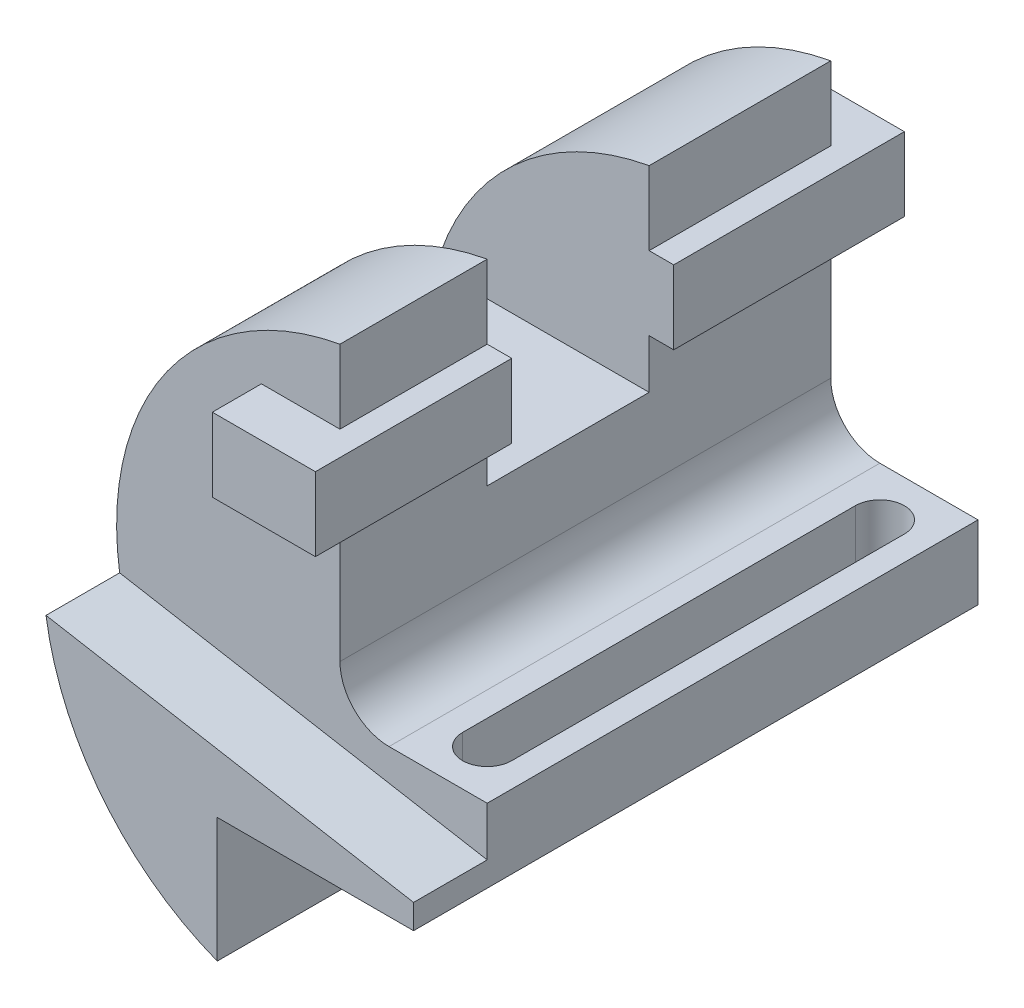
ISO-10303-21;
HEADER;
FILE_DESCRIPTION(('STEP AP214'),'2;1');
FILE_NAME('part.step','',(''),(''),'','','');
FILE_SCHEMA(('AUTOMOTIVE_DESIGN { 1 0 10303 214 1 1 1 1 }'));
ENDSEC;
DATA;
#1=APPLICATION_CONTEXT('core data for automotive mechanical design processes');
#2=APPLICATION_PROTOCOL_DEFINITION('international standard','automotive_design',2000,#1);
#3=PRODUCT_CONTEXT('',#1,'mechanical');
#4=PRODUCT('Part','Part','',(#3));
#5=PRODUCT_RELATED_PRODUCT_CATEGORY('part','',(#4));
#6=PRODUCT_DEFINITION_FORMATION('','',#4);
#7=PRODUCT_DEFINITION_CONTEXT('part definition',#1,'design');
#8=PRODUCT_DEFINITION('design','',#6,#7);
#9=PRODUCT_DEFINITION_SHAPE('','',#8);
#10=(LENGTH_UNIT() NAMED_UNIT(*) SI_UNIT(.MILLI.,.METRE.));
#11=(NAMED_UNIT(*) PLANE_ANGLE_UNIT() SI_UNIT($,.RADIAN.));
#12=(NAMED_UNIT(*) SI_UNIT($,.STERADIAN.) SOLID_ANGLE_UNIT());
#13=UNCERTAINTY_MEASURE_WITH_UNIT(LENGTH_MEASURE(1.E-05),#10,'distance_accuracy_value','');
#14=(GEOMETRIC_REPRESENTATION_CONTEXT(3) GLOBAL_UNCERTAINTY_ASSIGNED_CONTEXT((#13)) GLOBAL_UNIT_ASSIGNED_CONTEXT((#10,
#11,#12)) REPRESENTATION_CONTEXT('',''));
#15=CARTESIAN_POINT('',(0.,0.,0.));
#16=DIRECTION('',(0.,0.,1.));
#17=DIRECTION('',(1.,0.,0.));
#18=AXIS2_PLACEMENT_3D('',#15,#16,#17);
#19=CARTESIAN_POINT('',(0.,0.,115.));
#20=DIRECTION('',(-1.,0.,0.));
#21=DIRECTION('',(0.,-1.,0.));
#22=AXIS2_PLACEMENT_3D('',#19,#20,#21);
#23=PLANE('',#22);
#24=DIRECTION('',(0.,0.,1.));
#25=VECTOR('',#24,1.);
#26=CARTESIAN_POINT('',(0.,51.,115.));
#27=LINE('',#26,#25);
#28=CARTESIAN_POINT('',(0.,51.,70.));
#29=VERTEX_POINT('',#28);
#30=CARTESIAN_POINT('',(0.,51.,100.));
#31=VERTEX_POINT('',#30);
#32=EDGE_CURVE('E338',#29,#31,#27,.T.);
#33=ORIENTED_EDGE('',*,*,#32,.F.);
#34=DIRECTION('',(0.,1.,0.));
#35=VECTOR('',#34,1.);
#36=CARTESIAN_POINT('',(0.,0.,70.));
#37=LINE('',#36,#35);
#38=CARTESIAN_POINT('',(0.,66.,70.));
#39=VERTEX_POINT('',#38);
#40=EDGE_CURVE('E289',#29,#39,#37,.T.);
#41=ORIENTED_EDGE('',*,*,#40,.T.);
#42=DIRECTION('',(0.,0.,-1.));
#43=VECTOR('',#42,1.);
#44=CARTESIAN_POINT('',(0.,66.,115.));
#45=LINE('',#44,#43);
#46=CARTESIAN_POINT('',(0.,66.,100.));
#47=VERTEX_POINT('',#46);
#48=EDGE_CURVE('E406',#47,#39,#45,.T.);
#49=ORIENTED_EDGE('',*,*,#48,.F.);
#50=DIRECTION('',(0.,1.,0.));
#51=VECTOR('',#50,1.);
#52=CARTESIAN_POINT('',(0.,0.,100.));
#53=LINE('',#52,#51);
#54=EDGE_CURVE('E357',#31,#47,#53,.T.);
#55=ORIENTED_EDGE('',*,*,#54,.F.);
#56=EDGE_LOOP('',(#33,#41,#49,#55));
#57=FACE_BOUND('',#56,.T.);
#58=ADVANCED_FACE('F43',(#57),#23,.F.);
#59=CARTESIAN_POINT('',(-16.,36.,-10.));
#60=DIRECTION('',(0.,1.,0.));
#61=DIRECTION('',(0.,0.,1.));
#62=AXIS2_PLACEMENT_3D('',#59,#60,#61);
#63=PLANE('',#62);
#64=DIRECTION('',(0.,0.,-1.));
#65=VECTOR('',#64,1.);
#66=CARTESIAN_POINT('',(0.,36.,115.));
#67=LINE('',#66,#65);
#68=CARTESIAN_POINT('',(0.,36.,100.));
#69=VERTEX_POINT('',#68);
#70=CARTESIAN_POINT('',(0.,36.,70.));
#71=VERTEX_POINT('',#70);
#72=EDGE_CURVE('E347',#69,#71,#67,.T.);
#73=ORIENTED_EDGE('',*,*,#72,.T.);
#74=DIRECTION('',(1.,0.,0.));
#75=VECTOR('',#74,1.);
#76=CARTESIAN_POINT('',(-16.,36.,70.));
#77=LINE('',#76,#75);
#78=CARTESIAN_POINT('',(5.,36.,70.));
#79=VERTEX_POINT('',#78);
#80=EDGE_CURVE('E286',#71,#79,#77,.T.);
#81=ORIENTED_EDGE('',*,*,#80,.T.);
#82=DIRECTION('',(0.,0.,1.));
#83=VECTOR('',#82,1.);
#84=CARTESIAN_POINT('',(5.,36.,-10.));
#85=LINE('',#84,#83);
#86=CARTESIAN_POINT('',(5.,36.,110.));
#87=VERTEX_POINT('',#86);
#88=EDGE_CURVE('E334',#79,#87,#85,.T.);
#89=ORIENTED_EDGE('',*,*,#88,.T.);
#90=DIRECTION('',(-1.,0.,0.));
#91=VECTOR('',#90,1.);
#92=CARTESIAN_POINT('',(-16.,36.,110.));
#93=LINE('',#92,#91);
#94=CARTESIAN_POINT('',(-16.,36.,110.));
#95=VERTEX_POINT('',#94);
#96=EDGE_CURVE('E301',#87,#95,#93,.T.);
#97=ORIENTED_EDGE('',*,*,#96,.T.);
#98=DIRECTION('',(0.,0.,1.));
#99=VECTOR('',#98,1.);
#100=CARTESIAN_POINT('',(-16.,36.,-10.));
#101=LINE('',#100,#99);
#102=CARTESIAN_POINT('',(-16.,36.,100.));
#103=VERTEX_POINT('',#102);
#104=EDGE_CURVE('E330',#103,#95,#101,.T.);
#105=ORIENTED_EDGE('',*,*,#104,.F.);
#106=DIRECTION('',(-1.,0.,0.));
#107=VECTOR('',#106,1.);
#108=CARTESIAN_POINT('',(10.,36.,100.));
#109=LINE('',#108,#107);
#110=EDGE_CURVE('E415',#69,#103,#109,.T.);
#111=ORIENTED_EDGE('',*,*,#110,.F.);
#112=EDGE_LOOP('',(#73,#81,#89,#97,#105,#111));
#113=FACE_BOUND('',#112,.T.);
#114=ADVANCED_FACE('F513',(#113),#63,.F.);
#115=CARTESIAN_POINT('',(5.,51.,-10.));
#116=DIRECTION('',(0.,-1.,0.));
#117=DIRECTION('',(0.,0.,-1.));
#118=AXIS2_PLACEMENT_3D('',#115,#116,#117);
#119=PLANE('',#118);
#120=DIRECTION('',(0.,0.,1.));
#121=VECTOR('',#120,1.);
#122=CARTESIAN_POINT('',(5.,51.,-10.));
#123=LINE('',#122,#121);
#124=CARTESIAN_POINT('',(5.,51.,70.));
#125=VERTEX_POINT('',#124);
#126=CARTESIAN_POINT('',(5.,51.,110.));
#127=VERTEX_POINT('',#126);
#128=EDGE_CURVE('E322',#125,#127,#123,.T.);
#129=ORIENTED_EDGE('',*,*,#128,.F.);
#130=DIRECTION('',(-1.,0.,0.));
#131=VECTOR('',#130,1.);
#132=CARTESIAN_POINT('',(5.,51.,70.));
#133=LINE('',#132,#131);
#134=EDGE_CURVE('E283',#125,#29,#133,.T.);
#135=ORIENTED_EDGE('',*,*,#134,.T.);
#136=ORIENTED_EDGE('',*,*,#32,.T.);
#137=DIRECTION('',(1.,0.,0.));
#138=VECTOR('',#137,1.);
#139=CARTESIAN_POINT('',(10.,51.,100.));
#140=LINE('',#139,#138);
#141=CARTESIAN_POINT('',(-16.,51.,100.));
#142=VERTEX_POINT('',#141);
#143=EDGE_CURVE('E409',#142,#31,#140,.T.);
#144=ORIENTED_EDGE('',*,*,#143,.F.);
#145=DIRECTION('',(0.,0.,1.));
#146=VECTOR('',#145,1.);
#147=CARTESIAN_POINT('',(-16.,51.,-10.));
#148=LINE('',#147,#146);
#149=CARTESIAN_POINT('',(-16.,51.,110.));
#150=VERTEX_POINT('',#149);
#151=EDGE_CURVE('E326',#142,#150,#148,.T.);
#152=ORIENTED_EDGE('',*,*,#151,.T.);
#153=DIRECTION('',(1.,0.,0.));
#154=VECTOR('',#153,1.);
#155=CARTESIAN_POINT('',(5.,51.,110.));
#156=LINE('',#155,#154);
#157=EDGE_CURVE('E309',#150,#127,#156,.T.);
#158=ORIENTED_EDGE('',*,*,#157,.T.);
#159=EDGE_LOOP('',(#129,#135,#136,#144,#152,#158));
#160=FACE_BOUND('',#159,.T.);
#161=ADVANCED_FACE('F519',(#160),#119,.F.);
#162=CARTESIAN_POINT('',(5.,36.,-10.));
#163=DIRECTION('',(-1.,0.,0.));
#164=DIRECTION('',(0.,0.,1.));
#165=AXIS2_PLACEMENT_3D('',#162,#163,#164);
#166=PLANE('',#165);
#167=ORIENTED_EDGE('',*,*,#88,.F.);
#168=DIRECTION('',(0.,1.,0.));
#169=VECTOR('',#168,1.);
#170=CARTESIAN_POINT('',(5.,36.,70.));
#171=LINE('',#170,#169);
#172=EDGE_CURVE('E421',#79,#125,#171,.T.);
#173=ORIENTED_EDGE('',*,*,#172,.T.);
#174=ORIENTED_EDGE('',*,*,#128,.T.);
#175=DIRECTION('',(0.,-1.,0.));
#176=VECTOR('',#175,1.);
#177=CARTESIAN_POINT('',(5.,36.,110.));
#178=LINE('',#177,#176);
#179=EDGE_CURVE('E305',#127,#87,#178,.T.);
#180=ORIENTED_EDGE('',*,*,#179,.T.);
#181=EDGE_LOOP('',(#167,#173,#174,#180));
#182=FACE_BOUND('',#181,.T.);
#183=ADVANCED_FACE('F526',(#182),#166,.F.);
#184=CARTESIAN_POINT('',(0.,10.,100.));
#185=VERTEX_POINT('',#184);
#186=EDGE_CURVE('E358',#185,#69,#53,.T.);
#187=ORIENTED_EDGE('',*,*,#186,.F.);
#188=DIRECTION('',(0.,0.,-1.));
#189=VECTOR('',#188,1.);
#190=CARTESIAN_POINT('',(0.,10.,0.));
#191=LINE('',#190,#189);
#192=CARTESIAN_POINT('',(0.,10.,0.));
#193=VERTEX_POINT('',#192);
#194=EDGE_CURVE('E436',#185,#193,#191,.T.);
#195=ORIENTED_EDGE('',*,*,#194,.T.);
#196=DIRECTION('',(0.,1.,0.));
#197=VECTOR('',#196,1.);
#198=CARTESIAN_POINT('',(0.,0.,0.));
#199=LINE('',#198,#197);
#200=CARTESIAN_POINT('',(0.,36.,0.));
#201=VERTEX_POINT('',#200);
#202=EDGE_CURVE('E385',#193,#201,#199,.T.);
#203=ORIENTED_EDGE('',*,*,#202,.T.);
#204=CARTESIAN_POINT('',(0.,36.,37.));
#205=VERTEX_POINT('',#204);
#206=EDGE_CURVE('E346',#205,#201,#67,.T.);
#207=ORIENTED_EDGE('',*,*,#206,.F.);
#208=DIRECTION('',(0.,-1.,0.));
#209=VECTOR('',#208,1.);
#210=CARTESIAN_POINT('',(0.,0.,37.));
#211=LINE('',#210,#209);
#212=CARTESIAN_POINT('',(0.,26.,37.));
#213=VERTEX_POINT('',#212);
#214=EDGE_CURVE('E277',#205,#213,#211,.T.);
#215=ORIENTED_EDGE('',*,*,#214,.T.);
#216=DIRECTION('',(0.,0.,1.));
#217=VECTOR('',#216,1.);
#218=CARTESIAN_POINT('',(0.,26.,115.));
#219=LINE('',#218,#217);
#220=CARTESIAN_POINT('',(0.,26.,70.));
#221=VERTEX_POINT('',#220);
#222=EDGE_CURVE('E298',#213,#221,#219,.T.);
#223=ORIENTED_EDGE('',*,*,#222,.T.);
#224=DIRECTION('',(0.,1.,0.));
#225=VECTOR('',#224,1.);
#226=CARTESIAN_POINT('',(0.,0.,70.));
#227=LINE('',#226,#225);
#228=EDGE_CURVE('E292',#221,#71,#227,.T.);
#229=ORIENTED_EDGE('',*,*,#228,.T.);
#230=ORIENTED_EDGE('',*,*,#72,.F.);
#231=EDGE_LOOP('',(#187,#195,#203,#207,#215,#223,#229,#230));
#232=FACE_BOUND('',#231,.T.);
#233=ADVANCED_FACE('F442',(#232),#23,.F.);
#234=CARTESIAN_POINT('',(0.,66.,37.));
#235=VERTEX_POINT('',#234);
#236=CARTESIAN_POINT('',(0.,66.,0.));
#237=VERTEX_POINT('',#236);
#238=EDGE_CURVE('E405',#235,#237,#45,.T.);
#239=ORIENTED_EDGE('',*,*,#238,.F.);
#240=DIRECTION('',(0.,-1.,0.));
#241=VECTOR('',#240,1.);
#242=CARTESIAN_POINT('',(0.,0.,37.));
#243=LINE('',#242,#241);
#244=CARTESIAN_POINT('',(0.,51.,37.));
#245=VERTEX_POINT('',#244);
#246=EDGE_CURVE('E274',#235,#245,#243,.T.);
#247=ORIENTED_EDGE('',*,*,#246,.T.);
#248=CARTESIAN_POINT('',(0.,51.,0.));
#249=VERTEX_POINT('',#248);
#250=EDGE_CURVE('E339',#249,#245,#27,.T.);
#251=ORIENTED_EDGE('',*,*,#250,.F.);
#252=EDGE_CURVE('E384',#249,#237,#199,.T.);
#253=ORIENTED_EDGE('',*,*,#252,.T.);
#254=EDGE_LOOP('',(#239,#247,#251,#253));
#255=FACE_BOUND('',#254,.T.);
#256=ADVANCED_FACE('F476',(#255),#23,.F.);
#257=CARTESIAN_POINT('',(10.,11.4083339693685,0.));
#258=DIRECTION('',(0.,0.,1.));
#259=DIRECTION('',(1.,0.,0.));
#260=AXIS2_PLACEMENT_3D('',#257,#258,#259);
#261=PLANE('',#260);
#262=DIRECTION('',(-1.,0.,0.));
#263=VECTOR('',#262,1.);
#264=CARTESIAN_POINT('',(10.,36.,0.));
#265=LINE('',#264,#263);
#266=CARTESIAN_POINT('',(-16.,36.,0.));
#267=VERTEX_POINT('',#266);
#268=EDGE_CURVE('E350',#201,#267,#265,.T.);
#269=ORIENTED_EDGE('',*,*,#268,.F.);
#270=ORIENTED_EDGE('',*,*,#202,.F.);
#271=CARTESIAN_POINT('',(10.,10.,0.));
#272=DIRECTION('',(0.,0.,1.));
#273=DIRECTION('',(1.,0.,0.));
#274=AXIS2_PLACEMENT_3D('',#271,#272,#273);
#275=CIRCLE('',#274,10.);
#276=CARTESIAN_POINT('',(10.,0.,0.));
#277=VERTEX_POINT('',#276);
#278=EDGE_CURVE('E51',#193,#277,#275,.T.);
#279=ORIENTED_EDGE('',*,*,#278,.T.);
#280=DIRECTION('',(-1.,0.,0.));
#281=VECTOR('',#280,1.);
#282=CARTESIAN_POINT('',(0.,0.,0.));
#283=LINE('',#282,#281);
#284=CARTESIAN_POINT('',(30.,0.,0.));
#285=VERTEX_POINT('',#284);
#286=EDGE_CURVE('E370',#285,#277,#283,.T.);
#287=ORIENTED_EDGE('',*,*,#286,.F.);
#288=DIRECTION('',(0.,1.,0.));
#289=VECTOR('',#288,1.);
#290=CARTESIAN_POINT('',(30.,0.,0.));
#291=LINE('',#290,#289);
#292=CARTESIAN_POINT('',(30.,-15.,0.));
#293=VERTEX_POINT('',#292);
#294=EDGE_CURVE('E375',#293,#285,#291,.T.);
#295=ORIENTED_EDGE('',*,*,#294,.F.);
#296=DIRECTION('',(1.,0.,0.));
#297=VECTOR('',#296,1.);
#298=CARTESIAN_POINT('',(30.,-15.,0.));
#299=LINE('',#298,#297);
#300=CARTESIAN_POINT('',(-9.99999999999999,-15.,0.));
#301=VERTEX_POINT('',#300);
#302=EDGE_CURVE('E391',#301,#293,#299,.T.);
#303=ORIENTED_EDGE('',*,*,#302,.F.);
#304=DIRECTION('',(0.,1.,0.));
#305=VECTOR('',#304,1.);
#306=CARTESIAN_POINT('',(-9.99999999999999,-15.,0.));
#307=LINE('',#306,#305);
#308=CARTESIAN_POINT('',(-10.,-40.3627969821569,0.));
#309=VERTEX_POINT('',#308);
#310=EDGE_CURVE('E389',#309,#301,#307,.T.);
#311=ORIENTED_EDGE('',*,*,#310,.F.);
#312=CARTESIAN_POINT('',(10.,11.4083339693685,0.));
#313=DIRECTION('',(0.,0.,1.));
#314=DIRECTION('',(1.,0.,0.));
#315=AXIS2_PLACEMENT_3D('',#312,#313,#314);
#316=CIRCLE('',#315,55.5);
#317=EDGE_CURVE('E387',#237,#309,#316,.T.);
#318=ORIENTED_EDGE('',*,*,#317,.F.);
#319=ORIENTED_EDGE('',*,*,#252,.F.);
#320=DIRECTION('',(1.,0.,0.));
#321=VECTOR('',#320,1.);
#322=CARTESIAN_POINT('',(10.,51.,0.));
#323=LINE('',#322,#321);
#324=CARTESIAN_POINT('',(-16.,51.,0.));
#325=VERTEX_POINT('',#324);
#326=EDGE_CURVE('E342',#325,#249,#323,.T.);
#327=ORIENTED_EDGE('',*,*,#326,.F.);
#328=DIRECTION('',(0.,1.,0.));
#329=VECTOR('',#328,1.);
#330=CARTESIAN_POINT('',(-16.,11.4083339693685,0.));
#331=LINE('',#330,#329);
#332=EDGE_CURVE('E344',#267,#325,#331,.T.);
#333=ORIENTED_EDGE('',*,*,#332,.F.);
#334=EDGE_LOOP('',(#269,#270,#279,#287,#295,#303,#311,#318,#319,#327,#333));
#335=FACE_BOUND('',#334,.T.);
#336=ADVANCED_FACE('F449',(#335),#261,.F.);
#337=CARTESIAN_POINT('',(10.,11.4083339693685,100.));
#338=DIRECTION('',(0.,0.,1.));
#339=DIRECTION('',(1.,0.,0.));
#340=AXIS2_PLACEMENT_3D('',#337,#338,#339);
#341=PLANE('',#340);
#342=DIRECTION('',(-1.,0.,0.));
#343=VECTOR('',#342,1.);
#344=CARTESIAN_POINT('',(30.,0.,100.));
#345=LINE('',#344,#343);
#346=CARTESIAN_POINT('',(30.,0.,100.));
#347=VERTEX_POINT('',#346);
#348=CARTESIAN_POINT('',(10.,0.,100.));
#349=VERTEX_POINT('',#348);
#350=EDGE_CURVE('E355',#347,#349,#345,.T.);
#351=ORIENTED_EDGE('',*,*,#350,.T.);
#352=CARTESIAN_POINT('',(10.,10.,100.));
#353=DIRECTION('',(0.,0.,1.));
#354=DIRECTION('',(1.,0.,0.));
#355=AXIS2_PLACEMENT_3D('',#352,#353,#354);
#356=CIRCLE('',#355,10.);
#357=EDGE_CURVE('E12',#349,#185,#356,.F.);
#358=ORIENTED_EDGE('',*,*,#357,.T.);
#359=ORIENTED_EDGE('',*,*,#186,.T.);
#360=ORIENTED_EDGE('',*,*,#110,.T.);
#361=DIRECTION('',(0.,1.,0.));
#362=VECTOR('',#361,1.);
#363=CARTESIAN_POINT('',(-16.,11.4083339693685,100.));
#364=LINE('',#363,#362);
#365=EDGE_CURVE('E412',#103,#142,#364,.T.);
#366=ORIENTED_EDGE('',*,*,#365,.T.);
#367=ORIENTED_EDGE('',*,*,#143,.T.);
#368=ORIENTED_EDGE('',*,*,#54,.T.);
#369=CARTESIAN_POINT('',(10.,11.4083339693685,100.));
#370=DIRECTION('',(0.,0.,1.));
#371=DIRECTION('',(1.,0.,0.));
#372=AXIS2_PLACEMENT_3D('',#369,#370,#371);
#373=CIRCLE('',#372,55.5);
#374=CARTESIAN_POINT('',(-44.8904238568691,3.20520232265839,100.));
#375=VERTEX_POINT('',#374);
#376=EDGE_CURVE('E360',#47,#375,#373,.T.);
#377=ORIENTED_EDGE('',*,*,#376,.T.);
#378=DIRECTION('',(0.984807753012209,-0.173648177666924,0.));
#379=VECTOR('',#378,1.);
#380=CARTESIAN_POINT('',(30.,-10.,100.));
#381=LINE('',#380,#379);
#382=CARTESIAN_POINT('',(30.,-10.,100.));
#383=VERTEX_POINT('',#382);
#384=EDGE_CURVE('E362',#375,#383,#381,.T.);
#385=ORIENTED_EDGE('',*,*,#384,.T.);
#386=DIRECTION('',(0.,1.,0.));
#387=VECTOR('',#386,1.);
#388=CARTESIAN_POINT('',(30.,-10.,100.));
#389=LINE('',#388,#387);
#390=EDGE_CURVE('E353',#383,#347,#389,.T.);
#391=ORIENTED_EDGE('',*,*,#390,.T.);
#392=EDGE_LOOP('',(#351,#358,#359,#360,#366,#367,#368,#377,#385,#391));
#393=FACE_BOUND('',#392,.T.);
#394=ADVANCED_FACE('F501',(#393),#341,.T.);
#395=CARTESIAN_POINT('',(0.,0.,115.));
#396=DIRECTION('',(0.,-1.,0.));
#397=DIRECTION('',(0.,0.,-1.));
#398=AXIS2_PLACEMENT_3D('',#395,#396,#397);
#399=PLANE('',#398);
#400=DIRECTION('',(0.,0.,1.));
#401=VECTOR('',#400,1.);
#402=CARTESIAN_POINT('',(15.,0.,10.));
#403=LINE('',#402,#401);
#404=CARTESIAN_POINT('',(15.,0.,10.));
#405=VERTEX_POINT('',#404);
#406=CARTESIAN_POINT('',(15.,0.,90.));
#407=VERTEX_POINT('',#406);
#408=EDGE_CURVE('E244',#405,#407,#403,.T.);
#409=ORIENTED_EDGE('',*,*,#408,.F.);
#410=CARTESIAN_POINT('',(20.,0.,10.));
#411=DIRECTION('',(0.,1.,0.));
#412=DIRECTION('',(0.,0.,1.));
#413=AXIS2_PLACEMENT_3D('',#410,#411,#412);
#414=CIRCLE('',#413,5.);
#415=CARTESIAN_POINT('',(25.,0.,10.));
#416=VERTEX_POINT('',#415);
#417=EDGE_CURVE('E249',#416,#405,#414,.T.);
#418=ORIENTED_EDGE('',*,*,#417,.F.);
#419=DIRECTION('',(0.,0.,-1.));
#420=VECTOR('',#419,1.);
#421=CARTESIAN_POINT('',(25.,0.,10.));
#422=LINE('',#421,#420);
#423=CARTESIAN_POINT('',(25.,0.,90.));
#424=VERTEX_POINT('',#423);
#425=EDGE_CURVE('E253',#424,#416,#422,.T.);
#426=ORIENTED_EDGE('',*,*,#425,.F.);
#427=CARTESIAN_POINT('',(20.,0.,90.));
#428=DIRECTION('',(0.,1.,0.));
#429=DIRECTION('',(0.,0.,1.));
#430=AXIS2_PLACEMENT_3D('',#427,#428,#429);
#431=CIRCLE('',#430,5.);
#432=EDGE_CURVE('E233',#407,#424,#431,.T.);
#433=ORIENTED_EDGE('',*,*,#432,.F.);
#434=EDGE_LOOP('',(#409,#418,#426,#433));
#435=FACE_BOUND('',#434,.T.);
#436=ORIENTED_EDGE('',*,*,#286,.T.);
#437=DIRECTION('',(0.,0.,-1.));
#438=VECTOR('',#437,1.);
#439=CARTESIAN_POINT('',(10.,0.,100.));
#440=LINE('',#439,#438);
#441=EDGE_CURVE('E64',#277,#349,#440,.F.);
#442=ORIENTED_EDGE('',*,*,#441,.T.);
#443=ORIENTED_EDGE('',*,*,#350,.F.);
#444=DIRECTION('',(0.,0.,-1.));
#445=VECTOR('',#444,1.);
#446=CARTESIAN_POINT('',(30.,0.,115.));
#447=LINE('',#446,#445);
#448=EDGE_CURVE('E382',#347,#285,#447,.T.);
#449=ORIENTED_EDGE('',*,*,#448,.T.);
#450=EDGE_LOOP('',(#436,#442,#443,#449));
#451=FACE_BOUND('',#450,.T.);
#452=ADVANCED_FACE('F251',(#435,#451),#399,.F.);
#453=CARTESIAN_POINT('',(10.,11.4083339693685,115.));
#454=DIRECTION('',(0.,0.,-1.));
#455=DIRECTION('',(-1.,0.,0.));
#456=AXIS2_PLACEMENT_3D('',#453,#454,#455);
#457=CYLINDRICAL_SURFACE('',#456,55.5);
#458=ORIENTED_EDGE('',*,*,#48,.T.);
#459=CARTESIAN_POINT('',(10.,11.4083339693685,70.));
#460=DIRECTION('',(0.,0.,1.));
#461=DIRECTION('',(1.,0.,0.));
#462=AXIS2_PLACEMENT_3D('',#459,#460,#461);
#463=CIRCLE('',#462,55.5);
#464=CARTESIAN_POINT('',(-43.5474862383895,26.,70.));
#465=VERTEX_POINT('',#464);
#466=EDGE_CURVE('E295',#39,#465,#463,.T.);
#467=ORIENTED_EDGE('',*,*,#466,.T.);
#468=DIRECTION('',(0.,0.,-1.));
#469=VECTOR('',#468,1.);
#470=CARTESIAN_POINT('',(-43.5474862383895,26.,115.));
#471=LINE('',#470,#469);
#472=CARTESIAN_POINT('',(-43.5474862383895,26.,37.));
#473=VERTEX_POINT('',#472);
#474=EDGE_CURVE('E424',#465,#473,#471,.T.);
#475=ORIENTED_EDGE('',*,*,#474,.T.);
#476=CARTESIAN_POINT('',(10.,11.4083339693685,37.));
#477=DIRECTION('',(0.,0.,-1.));
#478=DIRECTION('',(0.,1.,0.));
#479=AXIS2_PLACEMENT_3D('',#476,#477,#478);
#480=CIRCLE('',#479,55.5);
#481=EDGE_CURVE('E280',#473,#235,#480,.T.);
#482=ORIENTED_EDGE('',*,*,#481,.T.);
#483=ORIENTED_EDGE('',*,*,#238,.T.);
#484=ORIENTED_EDGE('',*,*,#317,.T.);
#485=DIRECTION('',(0.,0.,-1.));
#486=VECTOR('',#485,1.);
#487=CARTESIAN_POINT('',(-10.,-40.3627969821569,115.));
#488=LINE('',#487,#486);
#489=CARTESIAN_POINT('',(-10.,-40.3627969821569,115.));
#490=VERTEX_POINT('',#489);
#491=EDGE_CURVE('E402',#490,#309,#488,.T.);
#492=ORIENTED_EDGE('',*,*,#491,.F.);
#493=CARTESIAN_POINT('',(10.,11.4083339693685,115.));
#494=DIRECTION('',(0.,0.,1.));
#495=DIRECTION('',(1.,0.,0.));
#496=AXIS2_PLACEMENT_3D('',#493,#494,#495);
#497=CIRCLE('',#496,55.5);
#498=CARTESIAN_POINT('',(-44.8904238568691,3.20520232265839,115.));
#499=VERTEX_POINT('',#498);
#500=EDGE_CURVE('E372',#499,#490,#497,.T.);
#501=ORIENTED_EDGE('',*,*,#500,.F.);
#502=DIRECTION('',(0.,0.,1.));
#503=VECTOR('',#502,1.);
#504=CARTESIAN_POINT('',(-44.8904238568691,3.20520232265839,100.));
#505=LINE('',#504,#503);
#506=EDGE_CURVE('E365',#375,#499,#505,.T.);
#507=ORIENTED_EDGE('',*,*,#506,.F.);
#508=ORIENTED_EDGE('',*,*,#376,.F.);
#509=EDGE_LOOP('',(#458,#467,#475,#482,#483,#484,#492,#501,#507,#508));
#510=FACE_BOUND('',#509,.T.);
#511=ADVANCED_FACE('F482',(#510),#457,.T.);
#512=CARTESIAN_POINT('',(-9.99999999999999,-15.,115.));
#513=DIRECTION('',(-1.,0.,0.));
#514=DIRECTION('',(0.,-1.,0.));
#515=AXIS2_PLACEMENT_3D('',#512,#513,#514);
#516=PLANE('',#515);
#517=ORIENTED_EDGE('',*,*,#310,.T.);
#518=DIRECTION('',(0.,0.,-1.));
#519=VECTOR('',#518,1.);
#520=CARTESIAN_POINT('',(-9.99999999999999,-15.,115.));
#521=LINE('',#520,#519);
#522=CARTESIAN_POINT('',(-9.99999999999999,-15.,115.));
#523=VERTEX_POINT('',#522);
#524=EDGE_CURVE('E399',#523,#301,#521,.T.);
#525=ORIENTED_EDGE('',*,*,#524,.F.);
#526=DIRECTION('',(0.,1.,0.));
#527=VECTOR('',#526,1.);
#528=CARTESIAN_POINT('',(-9.99999999999999,-15.,115.));
#529=LINE('',#528,#527);
#530=EDGE_CURVE('E374',#490,#523,#529,.T.);
#531=ORIENTED_EDGE('',*,*,#530,.F.);
#532=ORIENTED_EDGE('',*,*,#491,.T.);
#533=EDGE_LOOP('',(#517,#525,#531,#532));
#534=FACE_BOUND('',#533,.T.);
#535=ADVANCED_FACE('F486',(#534),#516,.F.);
#536=CARTESIAN_POINT('',(30.,-15.,115.));
#537=DIRECTION('',(0.,1.,0.));
#538=DIRECTION('',(-1.,0.,0.));
#539=AXIS2_PLACEMENT_3D('',#536,#537,#538);
#540=PLANE('',#539);
#541=DIRECTION('',(0.,0.,-1.));
#542=VECTOR('',#541,1.);
#543=CARTESIAN_POINT('',(25.,-15.,115.));
#544=LINE('',#543,#542);
#545=CARTESIAN_POINT('',(25.,-15.,90.));
#546=VERTEX_POINT('',#545);
#547=CARTESIAN_POINT('',(25.,-15.,10.));
#548=VERTEX_POINT('',#547);
#549=EDGE_CURVE('E430',#546,#548,#544,.T.);
#550=ORIENTED_EDGE('',*,*,#549,.T.);
#551=CARTESIAN_POINT('',(20.,-15.,10.));
#552=DIRECTION('',(0.,1.,0.));
#553=DIRECTION('',(-1.,0.,0.));
#554=AXIS2_PLACEMENT_3D('',#551,#552,#553);
#555=CIRCLE('',#554,5.);
#556=CARTESIAN_POINT('',(15.,-15.,10.));
#557=VERTEX_POINT('',#556);
#558=EDGE_CURVE('E433',#548,#557,#555,.T.);
#559=ORIENTED_EDGE('',*,*,#558,.T.);
#560=DIRECTION('',(0.,0.,1.));
#561=VECTOR('',#560,1.);
#562=CARTESIAN_POINT('',(15.,-15.,115.));
#563=LINE('',#562,#561);
#564=CARTESIAN_POINT('',(15.,-15.,90.));
#565=VERTEX_POINT('',#564);
#566=EDGE_CURVE('E427',#557,#565,#563,.T.);
#567=ORIENTED_EDGE('',*,*,#566,.T.);
#568=CARTESIAN_POINT('',(20.,-15.,90.));
#569=DIRECTION('',(0.,1.,0.));
#570=DIRECTION('',(-1.,0.,0.));
#571=AXIS2_PLACEMENT_3D('',#568,#569,#570);
#572=CIRCLE('',#571,5.);
#573=EDGE_CURVE('E236',#565,#546,#572,.T.);
#574=ORIENTED_EDGE('',*,*,#573,.T.);
#575=EDGE_LOOP('',(#550,#559,#567,#574));
#576=FACE_BOUND('',#575,.T.);
#577=ORIENTED_EDGE('',*,*,#302,.T.);
#578=DIRECTION('',(0.,0.,-1.));
#579=VECTOR('',#578,1.);
#580=CARTESIAN_POINT('',(30.,-15.,115.));
#581=LINE('',#580,#579);
#582=CARTESIAN_POINT('',(30.,-15.,115.));
#583=VERTEX_POINT('',#582);
#584=EDGE_CURVE('E396',#583,#293,#581,.T.);
#585=ORIENTED_EDGE('',*,*,#584,.F.);
#586=DIRECTION('',(1.,0.,0.));
#587=VECTOR('',#586,1.);
#588=CARTESIAN_POINT('',(30.,-15.,115.));
#589=LINE('',#588,#587);
#590=EDGE_CURVE('E377',#523,#583,#589,.T.);
#591=ORIENTED_EDGE('',*,*,#590,.F.);
#592=ORIENTED_EDGE('',*,*,#524,.T.);
#593=EDGE_LOOP('',(#577,#585,#591,#592));
#594=FACE_BOUND('',#593,.T.);
#595=ADVANCED_FACE('F566',(#576,#594),#540,.F.);
#596=CARTESIAN_POINT('',(30.,0.,115.));
#597=DIRECTION('',(-1.,0.,0.));
#598=DIRECTION('',(0.,-1.,0.));
#599=AXIS2_PLACEMENT_3D('',#596,#597,#598);
#600=PLANE('',#599);
#601=ORIENTED_EDGE('',*,*,#390,.F.);
#602=DIRECTION('',(0.,0.,1.));
#603=VECTOR('',#602,1.);
#604=CARTESIAN_POINT('',(30.,-10.,100.));
#605=LINE('',#604,#603);
#606=CARTESIAN_POINT('',(30.,-10.,115.));
#607=VERTEX_POINT('',#606);
#608=EDGE_CURVE('E367',#383,#607,#605,.T.);
#609=ORIENTED_EDGE('',*,*,#608,.T.);
#610=DIRECTION('',(0.,1.,0.));
#611=VECTOR('',#610,1.);
#612=CARTESIAN_POINT('',(30.,0.,115.));
#613=LINE('',#612,#611);
#614=EDGE_CURVE('E379',#583,#607,#613,.T.);
#615=ORIENTED_EDGE('',*,*,#614,.F.);
#616=ORIENTED_EDGE('',*,*,#584,.T.);
#617=ORIENTED_EDGE('',*,*,#294,.T.);
#618=ORIENTED_EDGE('',*,*,#448,.F.);
#619=EDGE_LOOP('',(#601,#609,#615,#616,#617,#618));
#620=FACE_BOUND('',#619,.T.);
#621=ADVANCED_FACE('F504',(#620),#600,.F.);
#622=CARTESIAN_POINT('',(10.,11.4083339693685,115.));
#623=DIRECTION('',(0.,0.,1.));
#624=DIRECTION('',(1.,0.,0.));
#625=AXIS2_PLACEMENT_3D('',#622,#623,#624);
#626=PLANE('',#625);
#627=DIRECTION('',(0.984807753012209,-0.173648177666924,0.));
#628=VECTOR('',#627,1.);
#629=CARTESIAN_POINT('',(30.,-10.,115.));
#630=LINE('',#629,#628);
#631=EDGE_CURVE('E352',#499,#607,#630,.T.);
#632=ORIENTED_EDGE('',*,*,#631,.F.);
#633=ORIENTED_EDGE('',*,*,#500,.T.);
#634=ORIENTED_EDGE('',*,*,#530,.T.);
#635=ORIENTED_EDGE('',*,*,#590,.T.);
#636=ORIENTED_EDGE('',*,*,#614,.T.);
#637=EDGE_LOOP('',(#632,#633,#634,#635,#636));
#638=FACE_BOUND('',#637,.T.);
#639=ADVANCED_FACE('F491',(#638),#626,.T.);
#640=CARTESIAN_POINT('',(30.,-10.,100.));
#641=DIRECTION('',(-0.173648177666924,-0.984807753012209,0.));
#642=DIRECTION('',(0.984807753012209,-0.173648177666924,0.));
#643=AXIS2_PLACEMENT_3D('',#640,#641,#642);
#644=PLANE('',#643);
#645=ORIENTED_EDGE('',*,*,#631,.T.);
#646=ORIENTED_EDGE('',*,*,#608,.F.);
#647=ORIENTED_EDGE('',*,*,#384,.F.);
#648=ORIENTED_EDGE('',*,*,#506,.T.);
#649=EDGE_LOOP('',(#645,#646,#647,#648));
#650=FACE_BOUND('',#649,.T.);
#651=ADVANCED_FACE('F498',(#650),#644,.F.);
#652=CARTESIAN_POINT('',(5.,36.,-10.));
#653=VERTEX_POINT('',#652);
#654=CARTESIAN_POINT('',(5.,36.,37.));
#655=VERTEX_POINT('',#654);
#656=EDGE_CURVE('E335',#653,#655,#85,.T.);
#657=ORIENTED_EDGE('',*,*,#656,.T.);
#658=DIRECTION('',(-1.,0.,0.));
#659=VECTOR('',#658,1.);
#660=CARTESIAN_POINT('',(-16.,36.,37.));
#661=LINE('',#660,#659);
#662=EDGE_CURVE('E271',#655,#205,#661,.T.);
#663=ORIENTED_EDGE('',*,*,#662,.T.);
#664=ORIENTED_EDGE('',*,*,#206,.T.);
#665=ORIENTED_EDGE('',*,*,#268,.T.);
#666=CARTESIAN_POINT('',(-16.,36.,-10.));
#667=VERTEX_POINT('',#666);
#668=EDGE_CURVE('E331',#667,#267,#101,.T.);
#669=ORIENTED_EDGE('',*,*,#668,.F.);
#670=DIRECTION('',(-1.,0.,0.));
#671=VECTOR('',#670,1.);
#672=CARTESIAN_POINT('',(-16.,36.,-10.));
#673=LINE('',#672,#671);
#674=EDGE_CURVE('E316',#653,#667,#673,.T.);
#675=ORIENTED_EDGE('',*,*,#674,.F.);
#676=EDGE_LOOP('',(#657,#663,#664,#665,#669,#675));
#677=FACE_BOUND('',#676,.T.);
#678=ADVANCED_FACE('F454',(#677),#63,.F.);
#679=CARTESIAN_POINT('',(-16.,51.,-10.));
#680=DIRECTION('',(1.,0.,0.));
#681=DIRECTION('',(0.,1.,0.));
#682=AXIS2_PLACEMENT_3D('',#679,#680,#681);
#683=PLANE('',#682);
#684=ORIENTED_EDGE('',*,*,#668,.T.);
#685=ORIENTED_EDGE('',*,*,#332,.T.);
#686=CARTESIAN_POINT('',(-16.,51.,-10.));
#687=VERTEX_POINT('',#686);
#688=EDGE_CURVE('E327',#687,#325,#148,.T.);
#689=ORIENTED_EDGE('',*,*,#688,.F.);
#690=DIRECTION('',(0.,1.,0.));
#691=VECTOR('',#690,1.);
#692=CARTESIAN_POINT('',(-16.,51.,-10.));
#693=LINE('',#692,#691);
#694=EDGE_CURVE('E318',#667,#687,#693,.T.);
#695=ORIENTED_EDGE('',*,*,#694,.F.);
#696=EDGE_LOOP('',(#684,#685,#689,#695));
#697=FACE_BOUND('',#696,.T.);
#698=ADVANCED_FACE('F457',(#697),#683,.F.);
#699=ORIENTED_EDGE('',*,*,#250,.T.);
#700=DIRECTION('',(1.,0.,0.));
#701=VECTOR('',#700,1.);
#702=CARTESIAN_POINT('',(5.,51.,37.));
#703=LINE('',#702,#701);
#704=CARTESIAN_POINT('',(5.,51.,37.));
#705=VERTEX_POINT('',#704);
#706=EDGE_CURVE('E266',#245,#705,#703,.T.);
#707=ORIENTED_EDGE('',*,*,#706,.T.);
#708=CARTESIAN_POINT('',(5.,51.,-10.));
#709=VERTEX_POINT('',#708);
#710=EDGE_CURVE('E323',#709,#705,#123,.T.);
#711=ORIENTED_EDGE('',*,*,#710,.F.);
#712=DIRECTION('',(1.,0.,0.));
#713=VECTOR('',#712,1.);
#714=CARTESIAN_POINT('',(5.,51.,-10.));
#715=LINE('',#714,#713);
#716=EDGE_CURVE('E320',#687,#709,#715,.T.);
#717=ORIENTED_EDGE('',*,*,#716,.F.);
#718=ORIENTED_EDGE('',*,*,#688,.T.);
#719=ORIENTED_EDGE('',*,*,#326,.T.);
#720=EDGE_LOOP('',(#699,#707,#711,#717,#718,#719));
#721=FACE_BOUND('',#720,.T.);
#722=ADVANCED_FACE('F470',(#721),#119,.F.);
#723=ORIENTED_EDGE('',*,*,#710,.T.);
#724=DIRECTION('',(0.,-1.,0.));
#725=VECTOR('',#724,1.);
#726=CARTESIAN_POINT('',(5.,36.,37.));
#727=LINE('',#726,#725);
#728=EDGE_CURVE('E418',#705,#655,#727,.T.);
#729=ORIENTED_EDGE('',*,*,#728,.T.);
#730=ORIENTED_EDGE('',*,*,#656,.F.);
#731=DIRECTION('',(0.,-1.,0.));
#732=VECTOR('',#731,1.);
#733=CARTESIAN_POINT('',(5.,36.,-10.));
#734=LINE('',#733,#732);
#735=EDGE_CURVE('E308',#709,#653,#734,.T.);
#736=ORIENTED_EDGE('',*,*,#735,.F.);
#737=EDGE_LOOP('',(#723,#729,#730,#736));
#738=FACE_BOUND('',#737,.T.);
#739=ADVANCED_FACE('F466',(#738),#166,.F.);
#740=ORIENTED_EDGE('',*,*,#365,.F.);
#741=ORIENTED_EDGE('',*,*,#104,.T.);
#742=DIRECTION('',(0.,1.,0.));
#743=VECTOR('',#742,1.);
#744=CARTESIAN_POINT('',(-16.,51.,110.));
#745=LINE('',#744,#743);
#746=EDGE_CURVE('E304',#95,#150,#745,.T.);
#747=ORIENTED_EDGE('',*,*,#746,.T.);
#748=ORIENTED_EDGE('',*,*,#151,.F.);
#749=EDGE_LOOP('',(#740,#741,#747,#748));
#750=FACE_BOUND('',#749,.T.);
#751=ADVANCED_FACE('F540',(#750),#683,.F.);
#752=CARTESIAN_POINT('',(0.,0.,-10.));
#753=DIRECTION('',(0.,0.,1.));
#754=DIRECTION('',(1.,0.,0.));
#755=AXIS2_PLACEMENT_3D('',#752,#753,#754);
#756=PLANE('',#755);
#757=ORIENTED_EDGE('',*,*,#735,.T.);
#758=ORIENTED_EDGE('',*,*,#674,.T.);
#759=ORIENTED_EDGE('',*,*,#694,.T.);
#760=ORIENTED_EDGE('',*,*,#716,.T.);
#761=EDGE_LOOP('',(#757,#758,#759,#760));
#762=FACE_BOUND('',#761,.T.);
#763=ADVANCED_FACE('F461',(#762),#756,.F.);
#764=CARTESIAN_POINT('',(10.,11.4083339693685,110.));
#765=DIRECTION('',(0.,0.,1.));
#766=DIRECTION('',(1.,0.,0.));
#767=AXIS2_PLACEMENT_3D('',#764,#765,#766);
#768=PLANE('',#767);
#769=ORIENTED_EDGE('',*,*,#179,.F.);
#770=ORIENTED_EDGE('',*,*,#157,.F.);
#771=ORIENTED_EDGE('',*,*,#746,.F.);
#772=ORIENTED_EDGE('',*,*,#96,.F.);
#773=EDGE_LOOP('',(#769,#770,#771,#772));
#774=FACE_BOUND('',#773,.T.);
#775=ADVANCED_FACE('F628',(#774),#768,.T.);
#776=CARTESIAN_POINT('',(-45.5,26.,37.));
#777=DIRECTION('',(0.,-1.,0.));
#778=DIRECTION('',(0.,0.,-1.));
#779=AXIS2_PLACEMENT_3D('',#776,#777,#778);
#780=PLANE('',#779);
#781=DIRECTION('',(1.,0.,0.));
#782=VECTOR('',#781,1.);
#783=CARTESIAN_POINT('',(-45.5,26.,37.));
#784=LINE('',#783,#782);
#785=EDGE_CURVE('E263',#473,#213,#784,.T.);
#786=ORIENTED_EDGE('',*,*,#785,.F.);
#787=ORIENTED_EDGE('',*,*,#474,.F.);
#788=DIRECTION('',(1.,0.,0.));
#789=VECTOR('',#788,1.);
#790=CARTESIAN_POINT('',(-45.5,26.,70.));
#791=LINE('',#790,#789);
#792=EDGE_CURVE('E260',#465,#221,#791,.T.);
#793=ORIENTED_EDGE('',*,*,#792,.T.);
#794=ORIENTED_EDGE('',*,*,#222,.F.);
#795=EDGE_LOOP('',(#786,#787,#793,#794));
#796=FACE_BOUND('',#795,.T.);
#797=ADVANCED_FACE('F622',(#796),#780,.F.);
#798=CARTESIAN_POINT('',(-45.5,26.,70.));
#799=DIRECTION('',(0.,0.,1.));
#800=DIRECTION('',(1.,0.,0.));
#801=AXIS2_PLACEMENT_3D('',#798,#799,#800);
#802=PLANE('',#801);
#803=ORIENTED_EDGE('',*,*,#40,.F.);
#804=ORIENTED_EDGE('',*,*,#134,.F.);
#805=ORIENTED_EDGE('',*,*,#172,.F.);
#806=ORIENTED_EDGE('',*,*,#80,.F.);
#807=ORIENTED_EDGE('',*,*,#228,.F.);
#808=ORIENTED_EDGE('',*,*,#792,.F.);
#809=ORIENTED_EDGE('',*,*,#466,.F.);
#810=EDGE_LOOP('',(#803,#804,#805,#806,#807,#808,#809));
#811=FACE_BOUND('',#810,.T.);
#812=ADVANCED_FACE('F627',(#811),#802,.F.);
#813=CARTESIAN_POINT('',(-45.5,66.,37.));
#814=DIRECTION('',(0.,0.,-1.));
#815=DIRECTION('',(0.,1.,0.));
#816=AXIS2_PLACEMENT_3D('',#813,#814,#815);
#817=PLANE('',#816);
#818=ORIENTED_EDGE('',*,*,#785,.T.);
#819=ORIENTED_EDGE('',*,*,#214,.F.);
#820=ORIENTED_EDGE('',*,*,#662,.F.);
#821=ORIENTED_EDGE('',*,*,#728,.F.);
#822=ORIENTED_EDGE('',*,*,#706,.F.);
#823=ORIENTED_EDGE('',*,*,#246,.F.);
#824=ORIENTED_EDGE('',*,*,#481,.F.);
#825=EDGE_LOOP('',(#818,#819,#820,#821,#822,#823,#824));
#826=FACE_BOUND('',#825,.T.);
#827=ADVANCED_FACE('F468',(#826),#817,.F.);
#828=CARTESIAN_POINT('',(20.,-40.3627969821569,10.));
#829=DIRECTION('',(0.,1.,0.));
#830=DIRECTION('',(0.,0.,1.));
#831=AXIS2_PLACEMENT_3D('',#828,#829,#830);
#832=CYLINDRICAL_SURFACE('',#831,5.);
#833=DIRECTION('',(0.,1.,0.));
#834=VECTOR('',#833,1.);
#835=CARTESIAN_POINT('',(25.,-40.3627969821569,10.));
#836=LINE('',#835,#834);
#837=EDGE_CURVE('E258',#548,#416,#836,.T.);
#838=ORIENTED_EDGE('',*,*,#837,.T.);
#839=ORIENTED_EDGE('',*,*,#417,.T.);
#840=DIRECTION('',(0.,1.,0.));
#841=VECTOR('',#840,1.);
#842=CARTESIAN_POINT('',(15.,-40.3627969821569,10.));
#843=LINE('',#842,#841);
#844=EDGE_CURVE('E240',#557,#405,#843,.T.);
#845=ORIENTED_EDGE('',*,*,#844,.F.);
#846=ORIENTED_EDGE('',*,*,#558,.F.);
#847=EDGE_LOOP('',(#838,#839,#845,#846));
#848=FACE_BOUND('',#847,.T.);
#849=ADVANCED_FACE('F651',(#848),#832,.F.);
#850=CARTESIAN_POINT('',(25.,-40.3627969821569,10.));
#851=DIRECTION('',(1.,0.,0.));
#852=DIRECTION('',(0.,0.,-1.));
#853=AXIS2_PLACEMENT_3D('',#850,#851,#852);
#854=PLANE('',#853);
#855=DIRECTION('',(0.,1.,0.));
#856=VECTOR('',#855,1.);
#857=CARTESIAN_POINT('',(25.,-40.3627969821569,90.));
#858=LINE('',#857,#856);
#859=EDGE_CURVE('E239',#546,#424,#858,.T.);
#860=ORIENTED_EDGE('',*,*,#859,.T.);
#861=ORIENTED_EDGE('',*,*,#425,.T.);
#862=ORIENTED_EDGE('',*,*,#837,.F.);
#863=ORIENTED_EDGE('',*,*,#549,.F.);
#864=EDGE_LOOP('',(#860,#861,#862,#863));
#865=FACE_BOUND('',#864,.T.);
#866=ADVANCED_FACE('F669',(#865),#854,.F.);
#867=CARTESIAN_POINT('',(20.,-40.3627969821569,90.));
#868=DIRECTION('',(0.,1.,0.));
#869=DIRECTION('',(0.,0.,1.));
#870=AXIS2_PLACEMENT_3D('',#867,#868,#869);
#871=CYLINDRICAL_SURFACE('',#870,5.);
#872=DIRECTION('',(0.,1.,0.));
#873=VECTOR('',#872,1.);
#874=CARTESIAN_POINT('',(15.,-40.3627969821569,90.));
#875=LINE('',#874,#873);
#876=EDGE_CURVE('E228',#565,#407,#875,.T.);
#877=ORIENTED_EDGE('',*,*,#876,.T.);
#878=ORIENTED_EDGE('',*,*,#432,.T.);
#879=ORIENTED_EDGE('',*,*,#859,.F.);
#880=ORIENTED_EDGE('',*,*,#573,.F.);
#881=EDGE_LOOP('',(#877,#878,#879,#880));
#882=FACE_BOUND('',#881,.T.);
#883=ADVANCED_FACE('F230',(#882),#871,.F.);
#884=CARTESIAN_POINT('',(15.,-40.3627969821569,10.));
#885=DIRECTION('',(-1.,0.,0.));
#886=DIRECTION('',(0.,0.,1.));
#887=AXIS2_PLACEMENT_3D('',#884,#885,#886);
#888=PLANE('',#887);
#889=ORIENTED_EDGE('',*,*,#844,.T.);
#890=ORIENTED_EDGE('',*,*,#408,.T.);
#891=ORIENTED_EDGE('',*,*,#876,.F.);
#892=ORIENTED_EDGE('',*,*,#566,.F.);
#893=EDGE_LOOP('',(#889,#890,#891,#892));
#894=FACE_BOUND('',#893,.T.);
#895=ADVANCED_FACE('F245',(#894),#888,.F.);
#896=CARTESIAN_POINT('',(10.,10.,115.));
#897=DIRECTION('',(0.,0.,1.));
#898=DIRECTION('',(1.,0.,0.));
#899=AXIS2_PLACEMENT_3D('',#896,#897,#898);
#900=CYLINDRICAL_SURFACE('',#899,10.);
#901=ORIENTED_EDGE('',*,*,#357,.F.);
#902=ORIENTED_EDGE('',*,*,#441,.F.);
#903=ORIENTED_EDGE('',*,*,#278,.F.);
#904=ORIENTED_EDGE('',*,*,#194,.F.);
#905=EDGE_LOOP('',(#901,#902,#903,#904));
#906=FACE_BOUND('',#905,.T.);
#907=ADVANCED_FACE('F45',(#906),#900,.F.);
#908=CLOSED_SHELL('',(#58,#114,#161,#183,#233,#256,#336,#394,#452,#511,#535,#595,#621,#639,#651,
#678,#698,#722,#739,#751,#763,#775,#797,#812,#827,#849,#866,#883,#895,#907));
#909=MANIFOLD_SOLID_BREP('B2',#908);
#910=ADVANCED_BREP_SHAPE_REPRESENTATION('',(#18,#909),#14);
#911=SHAPE_DEFINITION_REPRESENTATION(#9,#910);
ENDSEC;
END-ISO-10303-21;
